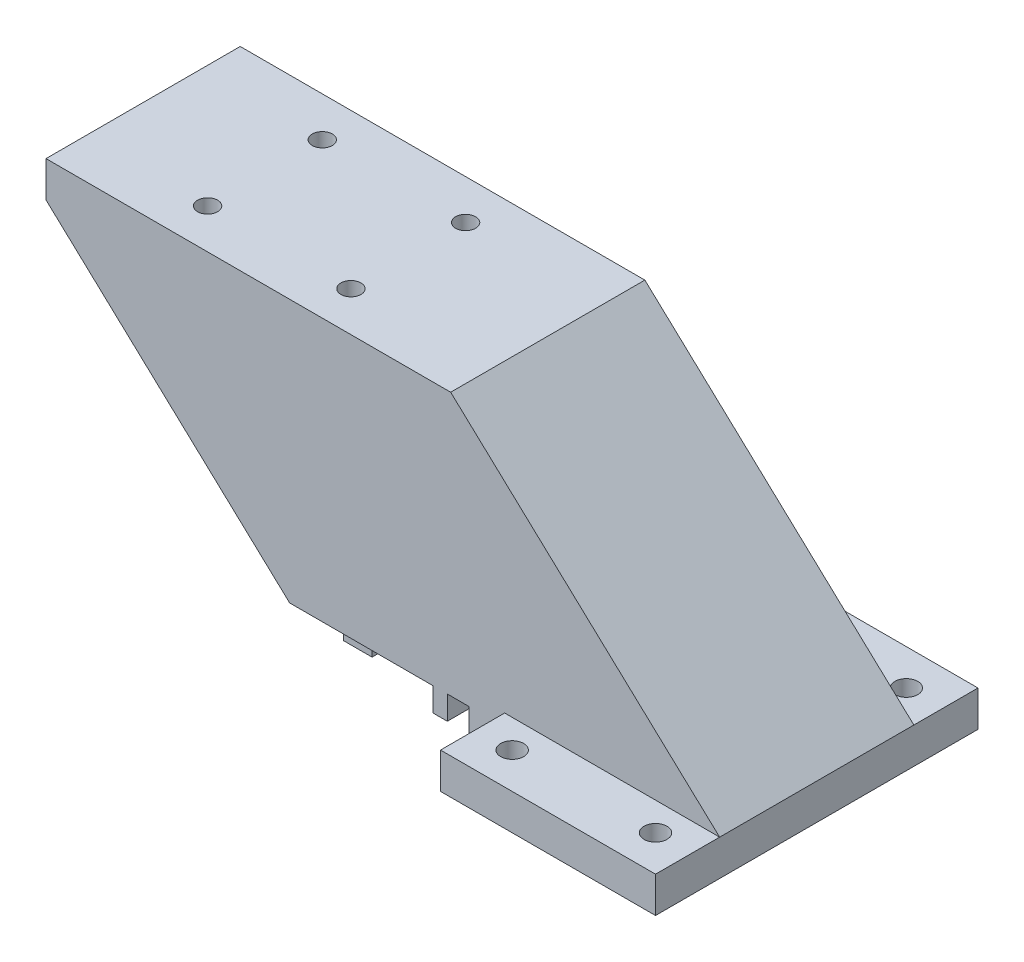
ISO-10303-21;
HEADER;
FILE_DESCRIPTION(('STEP AP214'),'2;1');
FILE_NAME('part.step','',(''),(''),'','','');
FILE_SCHEMA(('AUTOMOTIVE_DESIGN { 1 0 10303 214 1 1 1 1 }'));
ENDSEC;
DATA;
#1=APPLICATION_CONTEXT('core data for automotive mechanical design processes');
#2=APPLICATION_PROTOCOL_DEFINITION('international standard','automotive_design',2000,#1);
#3=PRODUCT_CONTEXT('',#1,'mechanical');
#4=PRODUCT('Part','Part','',(#3));
#5=PRODUCT_RELATED_PRODUCT_CATEGORY('part','',(#4));
#6=PRODUCT_DEFINITION_FORMATION('','',#4);
#7=PRODUCT_DEFINITION_CONTEXT('part definition',#1,'design');
#8=PRODUCT_DEFINITION('design','',#6,#7);
#9=PRODUCT_DEFINITION_SHAPE('','',#8);
#10=(LENGTH_UNIT() NAMED_UNIT(*) SI_UNIT(.MILLI.,.METRE.));
#11=(NAMED_UNIT(*) PLANE_ANGLE_UNIT() SI_UNIT($,.RADIAN.));
#12=(NAMED_UNIT(*) SI_UNIT($,.STERADIAN.) SOLID_ANGLE_UNIT());
#13=UNCERTAINTY_MEASURE_WITH_UNIT(LENGTH_MEASURE(1.E-05),#10,'distance_accuracy_value','');
#14=(GEOMETRIC_REPRESENTATION_CONTEXT(3) GLOBAL_UNCERTAINTY_ASSIGNED_CONTEXT((#13)) GLOBAL_UNIT_ASSIGNED_CONTEXT((#10,
#11,#12)) REPRESENTATION_CONTEXT('',''));
#15=CARTESIAN_POINT('',(0.,0.,0.));
#16=DIRECTION('',(0.,0.,1.));
#17=DIRECTION('',(1.,0.,0.));
#18=AXIS2_PLACEMENT_3D('',#15,#16,#17);
#19=CARTESIAN_POINT('',(0.,3.3,0.));
#20=DIRECTION('',(0.,1.,0.));
#21=DIRECTION('',(0.,0.,1.));
#22=AXIS2_PLACEMENT_3D('',#19,#20,#21);
#23=PLANE('',#22);
#24=DIRECTION('',(-1.,0.,0.));
#25=VECTOR('',#24,1.);
#26=CARTESIAN_POINT('',(-40.,3.3,-9.99999999999999));
#27=LINE('',#26,#25);
#28=CARTESIAN_POINT('',(-40.,3.3,-9.99999999999999));
#29=VERTEX_POINT('',#28);
#30=CARTESIAN_POINT('',(-45.,3.3,-9.99999999999999));
#31=VERTEX_POINT('',#30);
#32=EDGE_CURVE('E613',#29,#31,#27,.T.);
#33=ORIENTED_EDGE('',*,*,#32,.T.);
#34=DIRECTION('',(0.,0.,1.));
#35=VECTOR('',#34,1.);
#36=CARTESIAN_POINT('',(-45.,3.3,-22.5));
#37=LINE('',#36,#35);
#38=CARTESIAN_POINT('',(-45.,3.3,-13.55));
#39=VERTEX_POINT('',#38);
#40=EDGE_CURVE('E338',#39,#31,#37,.T.);
#41=ORIENTED_EDGE('',*,*,#40,.F.);
#42=DIRECTION('',(-1.,0.,0.));
#43=VECTOR('',#42,1.);
#44=CARTESIAN_POINT('',(0.,3.3,-13.55));
#45=LINE('',#44,#43);
#46=CARTESIAN_POINT('',(-40.,3.3,-13.55));
#47=VERTEX_POINT('',#46);
#48=EDGE_CURVE('E488',#47,#39,#45,.T.);
#49=ORIENTED_EDGE('',*,*,#48,.F.);
#50=DIRECTION('',(0.,0.,-1.));
#51=VECTOR('',#50,1.);
#52=CARTESIAN_POINT('',(-40.,3.3,0.));
#53=LINE('',#52,#51);
#54=EDGE_CURVE('E462',#29,#47,#53,.T.);
#55=ORIENTED_EDGE('',*,*,#54,.F.);
#56=EDGE_LOOP('',(#33,#41,#49,#55));
#57=FACE_BOUND('',#56,.T.);
#58=ADVANCED_FACE('F47',(#57),#23,.F.);
#59=CARTESIAN_POINT('',(-62.,0.,-8.));
#60=DIRECTION('',(0.,1.,0.));
#61=DIRECTION('',(0.,0.,1.));
#62=AXIS2_PLACEMENT_3D('',#59,#60,#61);
#63=CYLINDRICAL_SURFACE('',#62,1.4);
#64=CARTESIAN_POINT('',(-62.,40.,-8.));
#65=DIRECTION('',(0.,1.,0.));
#66=DIRECTION('',(0.,0.,1.));
#67=AXIS2_PLACEMENT_3D('',#64,#65,#66);
#68=CIRCLE('',#67,1.4);
#69=CARTESIAN_POINT('',(-62.,40.,-6.60000000000001));
#70=VERTEX_POINT('',#69);
#71=EDGE_CURVE('E368',#70,#70,#68,.T.);
#72=ORIENTED_EDGE('',*,*,#71,.T.);
#73=EDGE_LOOP('',(#72));
#74=FACE_BOUND('',#73,.T.);
#75=CARTESIAN_POINT('',(-62.,35.,-8.));
#76=DIRECTION('',(0.,-1.,0.));
#77=DIRECTION('',(1.,0.,0.));
#78=AXIS2_PLACEMENT_3D('',#75,#76,#77);
#79=CIRCLE('',#78,1.4);
#80=CARTESIAN_POINT('',(-60.6,35.,-8.));
#81=VERTEX_POINT('',#80);
#82=EDGE_CURVE('E644',#81,#81,#79,.F.);
#83=ORIENTED_EDGE('',*,*,#82,.F.);
#84=EDGE_LOOP('',(#83));
#85=FACE_BOUND('',#84,.T.);
#86=ADVANCED_FACE('F548',(#74,#85),#63,.F.);
#87=CARTESIAN_POINT('',(-62.,0.,8.));
#88=DIRECTION('',(0.,1.,0.));
#89=DIRECTION('',(0.,0.,1.));
#90=AXIS2_PLACEMENT_3D('',#87,#88,#89);
#91=CYLINDRICAL_SURFACE('',#90,1.40000000000016);
#92=CARTESIAN_POINT('',(-62.,40.,8.));
#93=DIRECTION('',(0.,1.,0.));
#94=DIRECTION('',(0.,0.,1.));
#95=AXIS2_PLACEMENT_3D('',#92,#93,#94);
#96=CIRCLE('',#95,1.40000000000016);
#97=CARTESIAN_POINT('',(-62.,40.,9.40000000000015));
#98=VERTEX_POINT('',#97);
#99=EDGE_CURVE('E363',#98,#98,#96,.T.);
#100=ORIENTED_EDGE('',*,*,#99,.T.);
#101=EDGE_LOOP('',(#100));
#102=FACE_BOUND('',#101,.T.);
#103=CARTESIAN_POINT('',(-62.,35.,8.));
#104=DIRECTION('',(0.,-1.,0.));
#105=DIRECTION('',(1.,0.,0.));
#106=AXIS2_PLACEMENT_3D('',#103,#104,#105);
#107=CIRCLE('',#106,1.40000000000016);
#108=CARTESIAN_POINT('',(-60.5999999999998,35.,8.));
#109=VERTEX_POINT('',#108);
#110=EDGE_CURVE('E640',#109,#109,#107,.F.);
#111=ORIENTED_EDGE('',*,*,#110,.F.);
#112=EDGE_LOOP('',(#111));
#113=FACE_BOUND('',#112,.T.);
#114=ADVANCED_FACE('F556',(#102,#113),#91,.F.);
#115=CARTESIAN_POINT('',(-42.,0.,-8.));
#116=DIRECTION('',(0.,1.,0.));
#117=DIRECTION('',(0.,0.,1.));
#118=AXIS2_PLACEMENT_3D('',#115,#116,#117);
#119=CYLINDRICAL_SURFACE('',#118,1.39999999999999);
#120=CARTESIAN_POINT('',(-42.,40.,-8.));
#121=DIRECTION('',(0.,1.,0.));
#122=DIRECTION('',(0.,0.,1.));
#123=AXIS2_PLACEMENT_3D('',#120,#121,#122);
#124=CIRCLE('',#123,1.39999999999999);
#125=CARTESIAN_POINT('',(-42.,40.,-6.60000000000001));
#126=VERTEX_POINT('',#125);
#127=EDGE_CURVE('E364',#126,#126,#124,.T.);
#128=ORIENTED_EDGE('',*,*,#127,.T.);
#129=EDGE_LOOP('',(#128));
#130=FACE_BOUND('',#129,.T.);
#131=CARTESIAN_POINT('',(-42.,35.,-8.));
#132=DIRECTION('',(0.,-1.,0.));
#133=DIRECTION('',(1.,0.,0.));
#134=AXIS2_PLACEMENT_3D('',#131,#132,#133);
#135=CIRCLE('',#134,1.39999999999999);
#136=CARTESIAN_POINT('',(-40.6,35.,-8.));
#137=VERTEX_POINT('',#136);
#138=EDGE_CURVE('E636',#137,#137,#135,.F.);
#139=ORIENTED_EDGE('',*,*,#138,.F.);
#140=EDGE_LOOP('',(#139));
#141=FACE_BOUND('',#140,.T.);
#142=ADVANCED_FACE('F718',(#130,#141),#119,.F.);
#143=CARTESIAN_POINT('',(-42.,0.,8.));
#144=DIRECTION('',(0.,1.,0.));
#145=DIRECTION('',(0.,0.,1.));
#146=AXIS2_PLACEMENT_3D('',#143,#144,#145);
#147=CYLINDRICAL_SURFACE('',#146,1.39999999999999);
#148=CARTESIAN_POINT('',(-42.,40.,8.));
#149=DIRECTION('',(0.,1.,0.));
#150=DIRECTION('',(0.,0.,1.));
#151=AXIS2_PLACEMENT_3D('',#148,#149,#150);
#152=CIRCLE('',#151,1.39999999999999);
#153=CARTESIAN_POINT('',(-42.,40.,9.39999999999999));
#154=VERTEX_POINT('',#153);
#155=EDGE_CURVE('E369',#154,#154,#152,.T.);
#156=ORIENTED_EDGE('',*,*,#155,.T.);
#157=EDGE_LOOP('',(#156));
#158=FACE_BOUND('',#157,.T.);
#159=CARTESIAN_POINT('',(-42.,35.,8.));
#160=DIRECTION('',(0.,-1.,0.));
#161=DIRECTION('',(1.,0.,0.));
#162=AXIS2_PLACEMENT_3D('',#159,#160,#161);
#163=CIRCLE('',#162,1.39999999999999);
#164=CARTESIAN_POINT('',(-40.6,35.,8.));
#165=VERTEX_POINT('',#164);
#166=EDGE_CURVE('E632',#165,#165,#163,.F.);
#167=ORIENTED_EDGE('',*,*,#166,.F.);
#168=EDGE_LOOP('',(#167));
#169=FACE_BOUND('',#168,.T.);
#170=ADVANCED_FACE('F721',(#158,#169),#147,.F.);
#171=CARTESIAN_POINT('',(-19.2806251128007,-20.6795348213005,-22.5));
#172=DIRECTION('',(-0.681934923661635,-0.731412851876832,0.));
#173=DIRECTION('',(0.731412851876832,-0.681934923661635,0.));
#174=AXIS2_PLACEMENT_3D('',#171,#172,#173);
#175=PLANE('',#174);
#176=ORIENTED_EDGE('',*,*,#40,.T.);
#177=DIRECTION('',(-0.731412851876832,0.681934923661635,0.));
#178=VECTOR('',#177,1.);
#179=CARTESIAN_POINT('',(-19.2806251128007,-20.6795348213005,-10.));
#180=LINE('',#179,#178);
#181=CARTESIAN_POINT('',(-79.,35.,-9.99999999999999));
#182=VERTEX_POINT('',#181);
#183=EDGE_CURVE('E56',#31,#182,#180,.T.);
#184=ORIENTED_EDGE('',*,*,#183,.T.);
#185=DIRECTION('',(0.,0.,1.));
#186=VECTOR('',#185,1.);
#187=CARTESIAN_POINT('',(-79.,35.,-22.5));
#188=LINE('',#187,#186);
#189=CARTESIAN_POINT('',(-79.,35.,-13.55));
#190=VERTEX_POINT('',#189);
#191=EDGE_CURVE('E335',#190,#182,#188,.T.);
#192=ORIENTED_EDGE('',*,*,#191,.F.);
#193=DIRECTION('',(-0.731412851876832,0.681934923661635,0.));
#194=VECTOR('',#193,1.);
#195=CARTESIAN_POINT('',(-20.926585804923,-19.1449185289395,-13.55));
#196=LINE('',#195,#194);
#197=EDGE_CURVE('E360',#39,#190,#196,.T.);
#198=ORIENTED_EDGE('',*,*,#197,.F.);
#199=EDGE_LOOP('',(#176,#184,#192,#198));
#200=FACE_BOUND('',#199,.T.);
#201=ADVANCED_FACE('F334',(#200),#175,.T.);
#202=CARTESIAN_POINT('',(-45.,3.3,10.));
#203=VERTEX_POINT('',#202);
#204=CARTESIAN_POINT('',(-45.,3.3,13.55));
#205=VERTEX_POINT('',#204);
#206=EDGE_CURVE('E351',#203,#205,#37,.T.);
#207=ORIENTED_EDGE('',*,*,#206,.F.);
#208=DIRECTION('',(-1.,0.,0.));
#209=VECTOR('',#208,1.);
#210=CARTESIAN_POINT('',(-40.,3.3,10.));
#211=LINE('',#210,#209);
#212=CARTESIAN_POINT('',(-40.,3.3,10.));
#213=VERTEX_POINT('',#212);
#214=EDGE_CURVE('E70',#213,#203,#211,.T.);
#215=ORIENTED_EDGE('',*,*,#214,.F.);
#216=CARTESIAN_POINT('',(-40.,3.3,11.05));
#217=VERTEX_POINT('',#216);
#218=EDGE_CURVE('E444',#217,#213,#53,.T.);
#219=ORIENTED_EDGE('',*,*,#218,.F.);
#220=DIRECTION('',(1.,0.,0.));
#221=VECTOR('',#220,1.);
#222=CARTESIAN_POINT('',(0.,3.3,11.05));
#223=LINE('',#222,#221);
#224=CARTESIAN_POINT('',(-36.,3.3,11.05));
#225=VERTEX_POINT('',#224);
#226=EDGE_CURVE('E458',#217,#225,#223,.T.);
#227=ORIENTED_EDGE('',*,*,#226,.T.);
#228=DIRECTION('',(0.,0.,-1.));
#229=VECTOR('',#228,1.);
#230=CARTESIAN_POINT('',(-36.,3.3,0.));
#231=LINE('',#230,#229);
#232=CARTESIAN_POINT('',(-36.,3.3,-13.55));
#233=VERTEX_POINT('',#232);
#234=EDGE_CURVE('E438',#225,#233,#231,.T.);
#235=ORIENTED_EDGE('',*,*,#234,.T.);
#236=CARTESIAN_POINT('',(-25.,3.3,-13.55));
#237=VERTEX_POINT('',#236);
#238=EDGE_CURVE('E494',#237,#233,#45,.T.);
#239=ORIENTED_EDGE('',*,*,#238,.F.);
#240=DIRECTION('',(0.,0.,-1.));
#241=VECTOR('',#240,1.);
#242=CARTESIAN_POINT('',(-25.,3.3,0.));
#243=LINE('',#242,#241);
#244=CARTESIAN_POINT('',(-25.,3.3,13.55));
#245=VERTEX_POINT('',#244);
#246=EDGE_CURVE('E385',#245,#237,#243,.T.);
#247=ORIENTED_EDGE('',*,*,#246,.F.);
#248=DIRECTION('',(-1.,0.,0.));
#249=VECTOR('',#248,1.);
#250=CARTESIAN_POINT('',(0.,3.3,13.55));
#251=LINE('',#250,#249);
#252=EDGE_CURVE('E493',#245,#205,#251,.T.);
#253=ORIENTED_EDGE('',*,*,#252,.T.);
#254=EDGE_LOOP('',(#207,#215,#219,#227,#235,#239,#247,#253));
#255=FACE_BOUND('',#254,.T.);
#256=ADVANCED_FACE('F551',(#255),#23,.F.);
#257=CARTESIAN_POINT('',(0.,3.3,-13.55));
#258=DIRECTION('',(0.,0.,-1.));
#259=DIRECTION('',(-1.,0.,0.));
#260=AXIS2_PLACEMENT_3D('',#257,#258,#259);
#261=PLANE('',#260);
#262=DIRECTION('',(-0.731353701619174,0.681998360062495,0.));
#263=VECTOR('',#262,1.);
#264=CARTESIAN_POINT('',(9.47073657256854,10.156121561309,-13.55));
#265=LINE('',#264,#263);
#266=CARTESIAN_POINT('',(15.,5.,-13.55));
#267=VERTEX_POINT('',#266);
#268=CARTESIAN_POINT('',(-22.5329048508643,40.,-13.55));
#269=VERTEX_POINT('',#268);
#270=EDGE_CURVE('E62',#267,#269,#265,.T.);
#271=ORIENTED_EDGE('',*,*,#270,.F.);
#272=DIRECTION('',(-1.,0.,0.));
#273=VECTOR('',#272,1.);
#274=CARTESIAN_POINT('',(0.,5.,-13.55));
#275=LINE('',#274,#273);
#276=CARTESIAN_POINT('',(-15.,5.,-13.55));
#277=VERTEX_POINT('',#276);
#278=EDGE_CURVE('E237',#267,#277,#275,.T.);
#279=ORIENTED_EDGE('',*,*,#278,.T.);
#280=DIRECTION('',(0.,1.,0.));
#281=VECTOR('',#280,1.);
#282=CARTESIAN_POINT('',(-15.,5.,-13.55));
#283=LINE('',#282,#281);
#284=CARTESIAN_POINT('',(-15.,0.,-13.55));
#285=VERTEX_POINT('',#284);
#286=EDGE_CURVE('E284',#285,#277,#283,.T.);
#287=ORIENTED_EDGE('',*,*,#286,.F.);
#288=DIRECTION('',(1.,0.,0.));
#289=VECTOR('',#288,1.);
#290=CARTESIAN_POINT('',(0.,0.,-13.55));
#291=LINE('',#290,#289);
#292=CARTESIAN_POINT('',(-20.,0.,-13.55));
#293=VERTEX_POINT('',#292);
#294=EDGE_CURVE('E423',#293,#285,#291,.T.);
#295=ORIENTED_EDGE('',*,*,#294,.F.);
#296=DIRECTION('',(0.,1.,0.));
#297=VECTOR('',#296,1.);
#298=CARTESIAN_POINT('',(-20.,0.,-13.55));
#299=LINE('',#298,#297);
#300=CARTESIAN_POINT('',(-20.,3.3,-13.55));
#301=VERTEX_POINT('',#300);
#302=EDGE_CURVE('E427',#293,#301,#299,.T.);
#303=ORIENTED_EDGE('',*,*,#302,.T.);
#304=CARTESIAN_POINT('',(-23.,3.3,-13.55));
#305=VERTEX_POINT('',#304);
#306=EDGE_CURVE('E489',#301,#305,#45,.T.);
#307=ORIENTED_EDGE('',*,*,#306,.T.);
#308=DIRECTION('',(0.,1.,0.));
#309=VECTOR('',#308,1.);
#310=CARTESIAN_POINT('',(-23.,0.,-13.55));
#311=LINE('',#310,#309);
#312=CARTESIAN_POINT('',(-23.,0.,-13.55));
#313=VERTEX_POINT('',#312);
#314=EDGE_CURVE('E394',#313,#305,#311,.T.);
#315=ORIENTED_EDGE('',*,*,#314,.F.);
#316=DIRECTION('',(1.,0.,0.));
#317=VECTOR('',#316,1.);
#318=CARTESIAN_POINT('',(0.,0.,-13.55));
#319=LINE('',#318,#317);
#320=CARTESIAN_POINT('',(-25.,0.,-13.55));
#321=VERTEX_POINT('',#320);
#322=EDGE_CURVE('E391',#321,#313,#319,.T.);
#323=ORIENTED_EDGE('',*,*,#322,.F.);
#324=DIRECTION('',(0.,1.,0.));
#325=VECTOR('',#324,1.);
#326=CARTESIAN_POINT('',(-25.,0.,-13.55));
#327=LINE('',#326,#325);
#328=EDGE_CURVE('E403',#321,#237,#327,.T.);
#329=ORIENTED_EDGE('',*,*,#328,.T.);
#330=ORIENTED_EDGE('',*,*,#238,.T.);
#331=DIRECTION('',(0.,1.,0.));
#332=VECTOR('',#331,1.);
#333=CARTESIAN_POINT('',(-36.,0.,-13.55));
#334=LINE('',#333,#332);
#335=CARTESIAN_POINT('',(-36.,0.,-13.55));
#336=VERTEX_POINT('',#335);
#337=EDGE_CURVE('E454',#336,#233,#334,.T.);
#338=ORIENTED_EDGE('',*,*,#337,.F.);
#339=DIRECTION('',(1.,0.,0.));
#340=VECTOR('',#339,1.);
#341=CARTESIAN_POINT('',(0.,0.,-13.55));
#342=LINE('',#341,#340);
#343=CARTESIAN_POINT('',(-40.,0.,-13.55));
#344=VERTEX_POINT('',#343);
#345=EDGE_CURVE('E451',#344,#336,#342,.T.);
#346=ORIENTED_EDGE('',*,*,#345,.F.);
#347=DIRECTION('',(0.,1.,0.));
#348=VECTOR('',#347,1.);
#349=CARTESIAN_POINT('',(-40.,0.,-13.55));
#350=LINE('',#349,#348);
#351=EDGE_CURVE('E469',#344,#47,#350,.T.);
#352=ORIENTED_EDGE('',*,*,#351,.T.);
#353=ORIENTED_EDGE('',*,*,#48,.T.);
#354=ORIENTED_EDGE('',*,*,#197,.T.);
#355=DIRECTION('',(0.,1.,0.));
#356=VECTOR('',#355,1.);
#357=CARTESIAN_POINT('',(-79.,3.3,-13.55));
#358=LINE('',#357,#356);
#359=CARTESIAN_POINT('',(-79.,40.,-13.55));
#360=VERTEX_POINT('',#359);
#361=EDGE_CURVE('E349',#190,#360,#358,.T.);
#362=ORIENTED_EDGE('',*,*,#361,.T.);
#363=DIRECTION('',(-1.,0.,0.));
#364=VECTOR('',#363,1.);
#365=CARTESIAN_POINT('',(0.,40.,-13.55));
#366=LINE('',#365,#364);
#367=EDGE_CURVE('E240',#269,#360,#366,.T.);
#368=ORIENTED_EDGE('',*,*,#367,.F.);
#369=EDGE_LOOP('',(#271,#279,#287,#295,#303,#307,#315,#323,#329,#330,#338,#346,#352,#353,#354,
#362,#368));
#370=FACE_BOUND('',#369,.T.);
#371=ADVANCED_FACE('F236',(#370),#261,.T.);
#372=CARTESIAN_POINT('',(0.,3.3,13.55));
#373=DIRECTION('',(0.,0.,-1.));
#374=DIRECTION('',(-1.,0.,0.));
#375=AXIS2_PLACEMENT_3D('',#372,#373,#374);
#376=PLANE('',#375);
#377=DIRECTION('',(-1.,0.,0.));
#378=VECTOR('',#377,1.);
#379=CARTESIAN_POINT('',(0.,5.,13.55));
#380=LINE('',#379,#378);
#381=CARTESIAN_POINT('',(15.,5.,13.55));
#382=VERTEX_POINT('',#381);
#383=CARTESIAN_POINT('',(-15.,5.,13.55));
#384=VERTEX_POINT('',#383);
#385=EDGE_CURVE('E255',#382,#384,#380,.T.);
#386=ORIENTED_EDGE('',*,*,#385,.F.);
#387=DIRECTION('',(-0.731353701619174,0.681998360062495,0.));
#388=VECTOR('',#387,1.);
#389=CARTESIAN_POINT('',(7.82475588963983,11.6910233796312,13.55));
#390=LINE('',#389,#388);
#391=CARTESIAN_POINT('',(-22.5329048508643,40.,13.55));
#392=VERTEX_POINT('',#391);
#393=EDGE_CURVE('E227',#382,#392,#390,.T.);
#394=ORIENTED_EDGE('',*,*,#393,.T.);
#395=DIRECTION('',(-1.,0.,0.));
#396=VECTOR('',#395,1.);
#397=CARTESIAN_POINT('',(0.,40.,13.55));
#398=LINE('',#397,#396);
#399=CARTESIAN_POINT('',(-79.,40.,13.55));
#400=VERTEX_POINT('',#399);
#401=EDGE_CURVE('E485',#392,#400,#398,.T.);
#402=ORIENTED_EDGE('',*,*,#401,.T.);
#403=DIRECTION('',(0.,1.,0.));
#404=VECTOR('',#403,1.);
#405=CARTESIAN_POINT('',(-79.,3.3,13.55));
#406=LINE('',#405,#404);
#407=CARTESIAN_POINT('',(-79.,35.,13.55));
#408=VERTEX_POINT('',#407);
#409=EDGE_CURVE('E498',#408,#400,#406,.T.);
#410=ORIENTED_EDGE('',*,*,#409,.F.);
#411=DIRECTION('',(0.731412851876832,-0.681934923661635,0.));
#412=VECTOR('',#411,1.);
#413=CARTESIAN_POINT('',(-19.2806251128007,-20.6795348213005,13.55));
#414=LINE('',#413,#412);
#415=EDGE_CURVE('E357',#408,#205,#414,.T.);
#416=ORIENTED_EDGE('',*,*,#415,.T.);
#417=ORIENTED_EDGE('',*,*,#252,.F.);
#418=DIRECTION('',(0.,1.,0.));
#419=VECTOR('',#418,1.);
#420=CARTESIAN_POINT('',(-25.,0.,13.55));
#421=LINE('',#420,#419);
#422=CARTESIAN_POINT('',(-25.,0.,13.55));
#423=VERTEX_POINT('',#422);
#424=EDGE_CURVE('E407',#423,#245,#421,.T.);
#425=ORIENTED_EDGE('',*,*,#424,.F.);
#426=DIRECTION('',(-1.,0.,0.));
#427=VECTOR('',#426,1.);
#428=CARTESIAN_POINT('',(0.,0.,13.55));
#429=LINE('',#428,#427);
#430=CARTESIAN_POINT('',(-23.,0.,13.55));
#431=VERTEX_POINT('',#430);
#432=EDGE_CURVE('E384',#431,#423,#429,.T.);
#433=ORIENTED_EDGE('',*,*,#432,.F.);
#434=DIRECTION('',(0.,1.,0.));
#435=VECTOR('',#434,1.);
#436=CARTESIAN_POINT('',(-23.,0.,13.55));
#437=LINE('',#436,#435);
#438=CARTESIAN_POINT('',(-23.,3.3,13.55));
#439=VERTEX_POINT('',#438);
#440=EDGE_CURVE('E411',#431,#439,#437,.T.);
#441=ORIENTED_EDGE('',*,*,#440,.T.);
#442=CARTESIAN_POINT('',(-20.,3.3,13.55));
#443=VERTEX_POINT('',#442);
#444=EDGE_CURVE('E495',#443,#439,#251,.T.);
#445=ORIENTED_EDGE('',*,*,#444,.F.);
#446=DIRECTION('',(0.,1.,0.));
#447=VECTOR('',#446,1.);
#448=CARTESIAN_POINT('',(-20.,0.,13.55));
#449=LINE('',#448,#447);
#450=CARTESIAN_POINT('',(-20.,0.,13.55));
#451=VERTEX_POINT('',#450);
#452=EDGE_CURVE('E434',#451,#443,#449,.T.);
#453=ORIENTED_EDGE('',*,*,#452,.F.);
#454=DIRECTION('',(-1.,0.,0.));
#455=VECTOR('',#454,1.);
#456=CARTESIAN_POINT('',(0.,0.,13.55));
#457=LINE('',#456,#455);
#458=CARTESIAN_POINT('',(-15.,0.,13.55));
#459=VERTEX_POINT('',#458);
#460=EDGE_CURVE('E416',#459,#451,#457,.T.);
#461=ORIENTED_EDGE('',*,*,#460,.F.);
#462=DIRECTION('',(0.,1.,0.));
#463=VECTOR('',#462,1.);
#464=CARTESIAN_POINT('',(-15.,5.,13.55));
#465=LINE('',#464,#463);
#466=EDGE_CURVE('E502',#459,#384,#465,.T.);
#467=ORIENTED_EDGE('',*,*,#466,.T.);
#468=EDGE_LOOP('',(#386,#394,#402,#410,#416,#417,#425,#433,#441,#445,#453,#461,#467));
#469=FACE_BOUND('',#468,.T.);
#470=ADVANCED_FACE('F577',(#469),#376,.F.);
#471=CARTESIAN_POINT('',(-79.,3.3,0.));
#472=DIRECTION('',(-1.,0.,0.));
#473=DIRECTION('',(0.,0.,1.));
#474=AXIS2_PLACEMENT_3D('',#471,#472,#473);
#475=PLANE('',#474);
#476=ORIENTED_EDGE('',*,*,#361,.F.);
#477=ORIENTED_EDGE('',*,*,#191,.T.);
#478=DIRECTION('',(0.,0.,1.));
#479=VECTOR('',#478,1.);
#480=CARTESIAN_POINT('',(-79.,35.,-9.99999999999999));
#481=LINE('',#480,#479);
#482=CARTESIAN_POINT('',(-79.,35.,10.));
#483=VERTEX_POINT('',#482);
#484=EDGE_CURVE('E347',#182,#483,#481,.T.);
#485=ORIENTED_EDGE('',*,*,#484,.T.);
#486=EDGE_CURVE('E352',#483,#408,#188,.T.);
#487=ORIENTED_EDGE('',*,*,#486,.T.);
#488=ORIENTED_EDGE('',*,*,#409,.T.);
#489=DIRECTION('',(0.,0.,1.));
#490=VECTOR('',#489,1.);
#491=CARTESIAN_POINT('',(-79.,40.,0.));
#492=LINE('',#491,#490);
#493=EDGE_CURVE('E481',#360,#400,#492,.T.);
#494=ORIENTED_EDGE('',*,*,#493,.F.);
#495=EDGE_LOOP('',(#476,#477,#485,#487,#488,#494));
#496=FACE_BOUND('',#495,.T.);
#497=ADVANCED_FACE('F345',(#496),#475,.T.);
#498=CARTESIAN_POINT('',(-15.,5.,0.));
#499=DIRECTION('',(1.,0.,0.));
#500=DIRECTION('',(0.,0.,-1.));
#501=AXIS2_PLACEMENT_3D('',#498,#499,#500);
#502=PLANE('',#501);
#503=ORIENTED_EDGE('',*,*,#466,.F.);
#504=DIRECTION('',(0.,0.,1.));
#505=VECTOR('',#504,1.);
#506=CARTESIAN_POINT('',(-15.,0.,0.));
#507=LINE('',#506,#505);
#508=CARTESIAN_POINT('',(-15.,0.,22.5));
#509=VERTEX_POINT('',#508);
#510=EDGE_CURVE('E304',#459,#509,#507,.T.);
#511=ORIENTED_EDGE('',*,*,#510,.T.);
#512=DIRECTION('',(0.,-1.,0.));
#513=VECTOR('',#512,1.);
#514=CARTESIAN_POINT('',(-15.,5.,22.5));
#515=LINE('',#514,#513);
#516=CARTESIAN_POINT('',(-15.,5.,22.5));
#517=VERTEX_POINT('',#516);
#518=EDGE_CURVE('E316',#517,#509,#515,.T.);
#519=ORIENTED_EDGE('',*,*,#518,.F.);
#520=DIRECTION('',(0.,0.,1.));
#521=VECTOR('',#520,1.);
#522=CARTESIAN_POINT('',(-15.,5.,0.));
#523=LINE('',#522,#521);
#524=EDGE_CURVE('E266',#384,#517,#523,.T.);
#525=ORIENTED_EDGE('',*,*,#524,.F.);
#526=EDGE_LOOP('',(#503,#511,#519,#525));
#527=FACE_BOUND('',#526,.T.);
#528=ADVANCED_FACE('F569',(#527),#502,.F.);
#529=CARTESIAN_POINT('',(-15.,0.,-22.5));
#530=VERTEX_POINT('',#529);
#531=EDGE_CURVE('E305',#530,#285,#507,.T.);
#532=ORIENTED_EDGE('',*,*,#531,.T.);
#533=ORIENTED_EDGE('',*,*,#286,.T.);
#534=CARTESIAN_POINT('',(-15.,5.,-22.5));
#535=VERTEX_POINT('',#534);
#536=EDGE_CURVE('E252',#535,#277,#523,.T.);
#537=ORIENTED_EDGE('',*,*,#536,.F.);
#538=DIRECTION('',(0.,-1.,0.));
#539=VECTOR('',#538,1.);
#540=CARTESIAN_POINT('',(-15.,5.,-22.5));
#541=LINE('',#540,#539);
#542=EDGE_CURVE('E320',#535,#530,#541,.T.);
#543=ORIENTED_EDGE('',*,*,#542,.T.);
#544=EDGE_LOOP('',(#532,#533,#537,#543));
#545=FACE_BOUND('',#544,.T.);
#546=ADVANCED_FACE('F564',(#545),#502,.F.);
#547=ORIENTED_EDGE('',*,*,#444,.T.);
#548=DIRECTION('',(0.,0.,-1.));
#549=VECTOR('',#548,1.);
#550=CARTESIAN_POINT('',(-23.,3.3,0.));
#551=LINE('',#550,#549);
#552=EDGE_CURVE('E379',#439,#305,#551,.T.);
#553=ORIENTED_EDGE('',*,*,#552,.T.);
#554=ORIENTED_EDGE('',*,*,#306,.F.);
#555=DIRECTION('',(0.,0.,-1.));
#556=VECTOR('',#555,1.);
#557=CARTESIAN_POINT('',(-20.,3.3,0.));
#558=LINE('',#557,#556);
#559=EDGE_CURVE('E415',#443,#301,#558,.T.);
#560=ORIENTED_EDGE('',*,*,#559,.F.);
#561=EDGE_LOOP('',(#547,#553,#554,#560));
#562=FACE_BOUND('',#561,.T.);
#563=ADVANCED_FACE('F545',(#562),#23,.F.);
#564=CARTESIAN_POINT('',(0.,5.,0.));
#565=DIRECTION('',(0.,1.,0.));
#566=DIRECTION('',(0.,0.,1.));
#567=AXIS2_PLACEMENT_3D('',#564,#565,#566);
#568=PLANE('',#567);
#569=CARTESIAN_POINT('',(10.0000000000002,5.,17.5));
#570=DIRECTION('',(0.,1.,0.));
#571=DIRECTION('',(0.,0.,1.));
#572=AXIS2_PLACEMENT_3D('',#569,#570,#571);
#573=CIRCLE('',#572,1.6);
#574=CARTESIAN_POINT('',(10.0000000000002,5.,19.1));
#575=VERTEX_POINT('',#574);
#576=EDGE_CURVE('E512',#575,#575,#573,.T.);
#577=ORIENTED_EDGE('',*,*,#576,.F.);
#578=EDGE_LOOP('',(#577));
#579=FACE_BOUND('',#578,.T.);
#580=CARTESIAN_POINT('',(-9.99999999999979,5.,17.5));
#581=DIRECTION('',(0.,1.,0.));
#582=DIRECTION('',(0.,0.,1.));
#583=AXIS2_PLACEMENT_3D('',#580,#581,#582);
#584=CIRCLE('',#583,1.6);
#585=CARTESIAN_POINT('',(-9.99999999999979,5.,19.1));
#586=VERTEX_POINT('',#585);
#587=EDGE_CURVE('E313',#586,#586,#584,.T.);
#588=ORIENTED_EDGE('',*,*,#587,.F.);
#589=EDGE_LOOP('',(#588));
#590=FACE_BOUND('',#589,.T.);
#591=DIRECTION('',(0.,0.,1.));
#592=VECTOR('',#591,1.);
#593=CARTESIAN_POINT('',(15.,5.,0.));
#594=LINE('',#593,#592);
#595=CARTESIAN_POINT('',(15.,5.,22.5));
#596=VERTEX_POINT('',#595);
#597=EDGE_CURVE('E262',#382,#596,#594,.T.);
#598=ORIENTED_EDGE('',*,*,#597,.F.);
#599=ORIENTED_EDGE('',*,*,#385,.T.);
#600=ORIENTED_EDGE('',*,*,#524,.T.);
#601=DIRECTION('',(1.,0.,0.));
#602=VECTOR('',#601,1.);
#603=CARTESIAN_POINT('',(0.,5.,22.5));
#604=LINE('',#603,#602);
#605=EDGE_CURVE('E274',#517,#596,#604,.T.);
#606=ORIENTED_EDGE('',*,*,#605,.T.);
#607=EDGE_LOOP('',(#598,#599,#600,#606));
#608=FACE_BOUND('',#607,.T.);
#609=ADVANCED_FACE('F531',(#579,#590,#608),#568,.T.);
#610=CARTESIAN_POINT('',(15.,5.,0.));
#611=DIRECTION('',(1.,0.,0.));
#612=DIRECTION('',(0.,0.,-1.));
#613=AXIS2_PLACEMENT_3D('',#610,#611,#612);
#614=PLANE('',#613);
#615=DIRECTION('',(0.,0.,-1.));
#616=VECTOR('',#615,1.);
#617=CARTESIAN_POINT('',(15.,5.,22.5));
#618=LINE('',#617,#616);
#619=EDGE_CURVE('E224',#382,#267,#618,.T.);
#620=ORIENTED_EDGE('',*,*,#619,.F.);
#621=ORIENTED_EDGE('',*,*,#597,.T.);
#622=DIRECTION('',(0.,-1.,0.));
#623=VECTOR('',#622,1.);
#624=CARTESIAN_POINT('',(15.,5.,22.5));
#625=LINE('',#624,#623);
#626=CARTESIAN_POINT('',(15.,0.,22.5));
#627=VERTEX_POINT('',#626);
#628=EDGE_CURVE('E278',#596,#627,#625,.T.);
#629=ORIENTED_EDGE('',*,*,#628,.T.);
#630=DIRECTION('',(0.,0.,1.));
#631=VECTOR('',#630,1.);
#632=CARTESIAN_POINT('',(15.,0.,0.));
#633=LINE('',#632,#631);
#634=CARTESIAN_POINT('',(15.,0.,-22.5));
#635=VERTEX_POINT('',#634);
#636=EDGE_CURVE('E296',#635,#627,#633,.T.);
#637=ORIENTED_EDGE('',*,*,#636,.F.);
#638=DIRECTION('',(0.,-1.,0.));
#639=VECTOR('',#638,1.);
#640=CARTESIAN_POINT('',(15.,5.,-22.5));
#641=LINE('',#640,#639);
#642=CARTESIAN_POINT('',(15.,5.,-22.5));
#643=VERTEX_POINT('',#642);
#644=EDGE_CURVE('E259',#643,#635,#641,.T.);
#645=ORIENTED_EDGE('',*,*,#644,.F.);
#646=EDGE_CURVE('E249',#643,#267,#594,.T.);
#647=ORIENTED_EDGE('',*,*,#646,.T.);
#648=EDGE_LOOP('',(#620,#621,#629,#637,#645,#647));
#649=FACE_BOUND('',#648,.T.);
#650=ADVANCED_FACE('F257',(#649),#614,.T.);
#651=CARTESIAN_POINT('',(0.,5.,-22.5));
#652=DIRECTION('',(0.,0.,-1.));
#653=DIRECTION('',(-1.,0.,0.));
#654=AXIS2_PLACEMENT_3D('',#651,#652,#653);
#655=PLANE('',#654);
#656=DIRECTION('',(1.,0.,0.));
#657=VECTOR('',#656,1.);
#658=CARTESIAN_POINT('',(0.,0.,-22.5));
#659=LINE('',#658,#657);
#660=EDGE_CURVE('E300',#530,#635,#659,.T.);
#661=ORIENTED_EDGE('',*,*,#660,.F.);
#662=ORIENTED_EDGE('',*,*,#542,.F.);
#663=DIRECTION('',(1.,0.,0.));
#664=VECTOR('',#663,1.);
#665=CARTESIAN_POINT('',(0.,5.,-22.5));
#666=LINE('',#665,#664);
#667=EDGE_CURVE('E261',#535,#643,#666,.T.);
#668=ORIENTED_EDGE('',*,*,#667,.T.);
#669=ORIENTED_EDGE('',*,*,#644,.T.);
#670=EDGE_LOOP('',(#661,#662,#668,#669));
#671=FACE_BOUND('',#670,.T.);
#672=ADVANCED_FACE('F808',(#671),#655,.T.);
#673=CARTESIAN_POINT('',(-10.,5.,-17.5));
#674=DIRECTION('',(0.,-1.,0.));
#675=DIRECTION('',(0.,0.,-1.));
#676=AXIS2_PLACEMENT_3D('',#673,#674,#675);
#677=CYLINDRICAL_SURFACE('',#676,1.6);
#678=CARTESIAN_POINT('',(-10.,5.,-17.5));
#679=DIRECTION('',(0.,1.,0.));
#680=DIRECTION('',(0.,0.,1.));
#681=AXIS2_PLACEMENT_3D('',#678,#679,#680);
#682=CIRCLE('',#681,1.6);
#683=CARTESIAN_POINT('',(-10.,5.,-15.9));
#684=VERTEX_POINT('',#683);
#685=EDGE_CURVE('E268',#684,#684,#682,.T.);
#686=ORIENTED_EDGE('',*,*,#685,.T.);
#687=EDGE_LOOP('',(#686));
#688=FACE_BOUND('',#687,.T.);
#689=CARTESIAN_POINT('',(-10.,0.,-17.5));
#690=DIRECTION('',(0.,1.,0.));
#691=DIRECTION('',(0.,0.,1.));
#692=AXIS2_PLACEMENT_3D('',#689,#690,#691);
#693=CIRCLE('',#692,1.6);
#694=CARTESIAN_POINT('',(-10.,0.,-15.9));
#695=VERTEX_POINT('',#694);
#696=EDGE_CURVE('E292',#695,#695,#693,.T.);
#697=ORIENTED_EDGE('',*,*,#696,.F.);
#698=EDGE_LOOP('',(#697));
#699=FACE_BOUND('',#698,.T.);
#700=ADVANCED_FACE('F524',(#688,#699),#677,.F.);
#701=CARTESIAN_POINT('',(10.,5.,-17.5));
#702=DIRECTION('',(0.,-1.,0.));
#703=DIRECTION('',(0.,0.,-1.));
#704=AXIS2_PLACEMENT_3D('',#701,#702,#703);
#705=CYLINDRICAL_SURFACE('',#704,1.6);
#706=CARTESIAN_POINT('',(10.,5.,-17.5));
#707=DIRECTION('',(0.,1.,0.));
#708=DIRECTION('',(0.,0.,1.));
#709=AXIS2_PLACEMENT_3D('',#706,#707,#708);
#710=CIRCLE('',#709,1.6);
#711=CARTESIAN_POINT('',(10.,5.,-15.9));
#712=VERTEX_POINT('',#711);
#713=EDGE_CURVE('E515',#712,#712,#710,.T.);
#714=ORIENTED_EDGE('',*,*,#713,.T.);
#715=EDGE_LOOP('',(#714));
#716=FACE_BOUND('',#715,.T.);
#717=CARTESIAN_POINT('',(10.,0.,-17.5));
#718=DIRECTION('',(0.,1.,0.));
#719=DIRECTION('',(0.,0.,1.));
#720=AXIS2_PLACEMENT_3D('',#717,#718,#719);
#721=CIRCLE('',#720,1.6);
#722=CARTESIAN_POINT('',(10.,0.,-15.9));
#723=VERTEX_POINT('',#722);
#724=EDGE_CURVE('E288',#723,#723,#721,.T.);
#725=ORIENTED_EDGE('',*,*,#724,.F.);
#726=EDGE_LOOP('',(#725));
#727=FACE_BOUND('',#726,.T.);
#728=ADVANCED_FACE('F937',(#716,#727),#705,.F.);
#729=CARTESIAN_POINT('',(10.0000000000002,5.,17.5));
#730=DIRECTION('',(0.,-1.,0.));
#731=DIRECTION('',(0.,0.,-1.));
#732=AXIS2_PLACEMENT_3D('',#729,#730,#731);
#733=CYLINDRICAL_SURFACE('',#732,1.6);
#734=ORIENTED_EDGE('',*,*,#576,.T.);
#735=EDGE_LOOP('',(#734));
#736=FACE_BOUND('',#735,.T.);
#737=CARTESIAN_POINT('',(10.0000000000002,0.,17.5));
#738=DIRECTION('',(0.,1.,0.));
#739=DIRECTION('',(0.,0.,1.));
#740=AXIS2_PLACEMENT_3D('',#737,#738,#739);
#741=CIRCLE('',#740,1.6);
#742=CARTESIAN_POINT('',(10.0000000000002,0.,19.1));
#743=VERTEX_POINT('',#742);
#744=EDGE_CURVE('E283',#743,#743,#741,.T.);
#745=ORIENTED_EDGE('',*,*,#744,.F.);
#746=EDGE_LOOP('',(#745));
#747=FACE_BOUND('',#746,.T.);
#748=ADVANCED_FACE('F928',(#736,#747),#733,.F.);
#749=CARTESIAN_POINT('',(-9.99999999999979,5.,17.5));
#750=DIRECTION('',(0.,-1.,0.));
#751=DIRECTION('',(0.,0.,-1.));
#752=AXIS2_PLACEMENT_3D('',#749,#750,#751);
#753=CYLINDRICAL_SURFACE('',#752,1.6);
#754=ORIENTED_EDGE('',*,*,#587,.T.);
#755=EDGE_LOOP('',(#754));
#756=FACE_BOUND('',#755,.T.);
#757=CARTESIAN_POINT('',(-9.99999999999979,0.,17.5));
#758=DIRECTION('',(0.,1.,0.));
#759=DIRECTION('',(0.,0.,1.));
#760=AXIS2_PLACEMENT_3D('',#757,#758,#759);
#761=CIRCLE('',#760,1.6);
#762=CARTESIAN_POINT('',(-9.99999999999979,0.,19.1));
#763=VERTEX_POINT('',#762);
#764=EDGE_CURVE('E279',#763,#763,#761,.T.);
#765=ORIENTED_EDGE('',*,*,#764,.F.);
#766=EDGE_LOOP('',(#765));
#767=FACE_BOUND('',#766,.T.);
#768=ADVANCED_FACE('F49',(#756,#767),#753,.F.);
#769=CARTESIAN_POINT('',(0.,5.,22.5));
#770=DIRECTION('',(0.,0.,-1.));
#771=DIRECTION('',(-1.,0.,0.));
#772=AXIS2_PLACEMENT_3D('',#769,#770,#771);
#773=PLANE('',#772);
#774=DIRECTION('',(1.,0.,0.));
#775=VECTOR('',#774,1.);
#776=CARTESIAN_POINT('',(0.,0.,22.5));
#777=LINE('',#776,#775);
#778=EDGE_CURVE('E309',#509,#627,#777,.T.);
#779=ORIENTED_EDGE('',*,*,#778,.T.);
#780=ORIENTED_EDGE('',*,*,#628,.F.);
#781=ORIENTED_EDGE('',*,*,#605,.F.);
#782=ORIENTED_EDGE('',*,*,#518,.T.);
#783=EDGE_LOOP('',(#779,#780,#781,#782));
#784=FACE_BOUND('',#783,.T.);
#785=ADVANCED_FACE('F529',(#784),#773,.F.);
#786=ORIENTED_EDGE('',*,*,#278,.F.);
#787=ORIENTED_EDGE('',*,*,#646,.F.);
#788=ORIENTED_EDGE('',*,*,#667,.F.);
#789=ORIENTED_EDGE('',*,*,#536,.T.);
#790=EDGE_LOOP('',(#786,#787,#788,#789));
#791=FACE_BOUND('',#790,.T.);
#792=ORIENTED_EDGE('',*,*,#713,.F.);
#793=EDGE_LOOP('',(#792));
#794=FACE_BOUND('',#793,.T.);
#795=ORIENTED_EDGE('',*,*,#685,.F.);
#796=EDGE_LOOP('',(#795));
#797=FACE_BOUND('',#796,.T.);
#798=ADVANCED_FACE('F246',(#791,#794,#797),#568,.T.);
#799=CARTESIAN_POINT('',(0.,0.,0.));
#800=DIRECTION('',(0.,1.,0.));
#801=DIRECTION('',(0.,0.,1.));
#802=AXIS2_PLACEMENT_3D('',#799,#800,#801);
#803=PLANE('',#802);
#804=ORIENTED_EDGE('',*,*,#764,.T.);
#805=EDGE_LOOP('',(#804));
#806=FACE_BOUND('',#805,.T.);
#807=ORIENTED_EDGE('',*,*,#744,.T.);
#808=EDGE_LOOP('',(#807));
#809=FACE_BOUND('',#808,.T.);
#810=ORIENTED_EDGE('',*,*,#724,.T.);
#811=EDGE_LOOP('',(#810));
#812=FACE_BOUND('',#811,.T.);
#813=ORIENTED_EDGE('',*,*,#696,.T.);
#814=EDGE_LOOP('',(#813));
#815=FACE_BOUND('',#814,.T.);
#816=ORIENTED_EDGE('',*,*,#636,.T.);
#817=ORIENTED_EDGE('',*,*,#778,.F.);
#818=ORIENTED_EDGE('',*,*,#510,.F.);
#819=ORIENTED_EDGE('',*,*,#460,.T.);
#820=DIRECTION('',(0.,0.,-1.));
#821=VECTOR('',#820,1.);
#822=CARTESIAN_POINT('',(-20.,0.,0.));
#823=LINE('',#822,#821);
#824=EDGE_CURVE('E420',#451,#293,#823,.T.);
#825=ORIENTED_EDGE('',*,*,#824,.T.);
#826=ORIENTED_EDGE('',*,*,#294,.T.);
#827=ORIENTED_EDGE('',*,*,#531,.F.);
#828=ORIENTED_EDGE('',*,*,#660,.T.);
#829=EDGE_LOOP('',(#816,#817,#818,#819,#825,#826,#827,#828));
#830=FACE_BOUND('',#829,.T.);
#831=ADVANCED_FACE('F528',(#806,#809,#812,#815,#830),#803,.F.);
#832=CARTESIAN_POINT('',(0.,40.,0.));
#833=DIRECTION('',(0.,1.,0.));
#834=DIRECTION('',(0.,0.,1.));
#835=AXIS2_PLACEMENT_3D('',#832,#833,#834);
#836=PLANE('',#835);
#837=DIRECTION('',(0.,0.,1.));
#838=VECTOR('',#837,1.);
#839=CARTESIAN_POINT('',(-22.5329048508643,40.,0.));
#840=LINE('',#839,#838);
#841=EDGE_CURVE('E11',#269,#392,#840,.T.);
#842=ORIENTED_EDGE('',*,*,#841,.F.);
#843=ORIENTED_EDGE('',*,*,#367,.T.);
#844=ORIENTED_EDGE('',*,*,#493,.T.);
#845=ORIENTED_EDGE('',*,*,#401,.F.);
#846=EDGE_LOOP('',(#842,#843,#844,#845));
#847=FACE_BOUND('',#846,.T.);
#848=ORIENTED_EDGE('',*,*,#99,.F.);
#849=EDGE_LOOP('',(#848));
#850=FACE_BOUND('',#849,.T.);
#851=ORIENTED_EDGE('',*,*,#155,.F.);
#852=EDGE_LOOP('',(#851));
#853=FACE_BOUND('',#852,.T.);
#854=ORIENTED_EDGE('',*,*,#127,.F.);
#855=EDGE_LOOP('',(#854));
#856=FACE_BOUND('',#855,.T.);
#857=ORIENTED_EDGE('',*,*,#71,.F.);
#858=EDGE_LOOP('',(#857));
#859=FACE_BOUND('',#858,.T.);
#860=ADVANCED_FACE('F537',(#847,#850,#853,#856,#859),#836,.T.);
#861=CARTESIAN_POINT('',(-36.,0.,0.));
#862=DIRECTION('',(1.,0.,0.));
#863=DIRECTION('',(0.,0.,-1.));
#864=AXIS2_PLACEMENT_3D('',#861,#862,#863);
#865=PLANE('',#864);
#866=ORIENTED_EDGE('',*,*,#234,.F.);
#867=DIRECTION('',(0.,1.,0.));
#868=VECTOR('',#867,1.);
#869=CARTESIAN_POINT('',(-36.,0.,11.05));
#870=LINE('',#869,#868);
#871=CARTESIAN_POINT('',(-36.,0.,11.05));
#872=VERTEX_POINT('',#871);
#873=EDGE_CURVE('E476',#872,#225,#870,.T.);
#874=ORIENTED_EDGE('',*,*,#873,.F.);
#875=DIRECTION('',(0.,0.,-1.));
#876=VECTOR('',#875,1.);
#877=CARTESIAN_POINT('',(-36.,0.,0.));
#878=LINE('',#877,#876);
#879=EDGE_CURVE('E439',#872,#336,#878,.T.);
#880=ORIENTED_EDGE('',*,*,#879,.T.);
#881=ORIENTED_EDGE('',*,*,#337,.T.);
#882=EDGE_LOOP('',(#866,#874,#880,#881));
#883=FACE_BOUND('',#882,.T.);
#884=ADVANCED_FACE('F685',(#883),#865,.T.);
#885=CARTESIAN_POINT('',(0.,0.,11.05));
#886=DIRECTION('',(0.,0.,1.));
#887=DIRECTION('',(1.,0.,0.));
#888=AXIS2_PLACEMENT_3D('',#885,#886,#887);
#889=PLANE('',#888);
#890=ORIENTED_EDGE('',*,*,#226,.F.);
#891=DIRECTION('',(0.,1.,0.));
#892=VECTOR('',#891,1.);
#893=CARTESIAN_POINT('',(-40.,0.,11.05));
#894=LINE('',#893,#892);
#895=CARTESIAN_POINT('',(-40.,0.,11.05));
#896=VERTEX_POINT('',#895);
#897=EDGE_CURVE('E473',#896,#217,#894,.T.);
#898=ORIENTED_EDGE('',*,*,#897,.F.);
#899=DIRECTION('',(1.,0.,0.));
#900=VECTOR('',#899,1.);
#901=CARTESIAN_POINT('',(0.,0.,11.05));
#902=LINE('',#901,#900);
#903=EDGE_CURVE('E443',#896,#872,#902,.T.);
#904=ORIENTED_EDGE('',*,*,#903,.T.);
#905=ORIENTED_EDGE('',*,*,#873,.T.);
#906=EDGE_LOOP('',(#890,#898,#904,#905));
#907=FACE_BOUND('',#906,.T.);
#908=ADVANCED_FACE('F682',(#907),#889,.T.);
#909=CARTESIAN_POINT('',(-40.,0.,0.));
#910=DIRECTION('',(1.,0.,0.));
#911=DIRECTION('',(0.,0.,-1.));
#912=AXIS2_PLACEMENT_3D('',#909,#910,#911);
#913=PLANE('',#912);
#914=ORIENTED_EDGE('',*,*,#218,.T.);
#915=DIRECTION('',(0.,-1.,0.));
#916=VECTOR('',#915,1.);
#917=CARTESIAN_POINT('',(-40.,3.3,10.));
#918=LINE('',#917,#916);
#919=CARTESIAN_POINT('',(-40.,8.3,10.));
#920=VERTEX_POINT('',#919);
#921=EDGE_CURVE('E999',#920,#213,#918,.T.);
#922=ORIENTED_EDGE('',*,*,#921,.F.);
#923=DIRECTION('',(0.,0.,1.));
#924=VECTOR('',#923,1.);
#925=CARTESIAN_POINT('',(-40.,8.3,-9.99999999999999));
#926=LINE('',#925,#924);
#927=CARTESIAN_POINT('',(-40.,8.3,-9.99999999999999));
#928=VERTEX_POINT('',#927);
#929=EDGE_CURVE('E615',#928,#920,#926,.T.);
#930=ORIENTED_EDGE('',*,*,#929,.F.);
#931=DIRECTION('',(0.,-1.,0.));
#932=VECTOR('',#931,1.);
#933=CARTESIAN_POINT('',(-40.,3.3,-9.99999999999999));
#934=LINE('',#933,#932);
#935=EDGE_CURVE('E610',#928,#29,#934,.T.);
#936=ORIENTED_EDGE('',*,*,#935,.T.);
#937=ORIENTED_EDGE('',*,*,#54,.T.);
#938=ORIENTED_EDGE('',*,*,#351,.F.);
#939=DIRECTION('',(0.,0.,-1.));
#940=VECTOR('',#939,1.);
#941=CARTESIAN_POINT('',(-40.,0.,0.));
#942=LINE('',#941,#940);
#943=EDGE_CURVE('E448',#896,#344,#942,.T.);
#944=ORIENTED_EDGE('',*,*,#943,.F.);
#945=ORIENTED_EDGE('',*,*,#897,.T.);
#946=EDGE_LOOP('',(#914,#922,#930,#936,#937,#938,#944,#945));
#947=FACE_BOUND('',#946,.T.);
#948=ADVANCED_FACE('F605',(#947),#913,.F.);
#949=CARTESIAN_POINT('',(0.,0.,0.));
#950=DIRECTION('',(0.,-1.,0.));
#951=DIRECTION('',(0.,0.,-1.));
#952=AXIS2_PLACEMENT_3D('',#949,#950,#951);
#953=PLANE('',#952);
#954=ORIENTED_EDGE('',*,*,#879,.F.);
#955=ORIENTED_EDGE('',*,*,#903,.F.);
#956=ORIENTED_EDGE('',*,*,#943,.T.);
#957=ORIENTED_EDGE('',*,*,#345,.T.);
#958=EDGE_LOOP('',(#954,#955,#956,#957));
#959=FACE_BOUND('',#958,.T.);
#960=ADVANCED_FACE('F676',(#959),#953,.T.);
#961=CARTESIAN_POINT('',(-20.,0.,0.));
#962=DIRECTION('',(1.,0.,0.));
#963=DIRECTION('',(0.,0.,-1.));
#964=AXIS2_PLACEMENT_3D('',#961,#962,#963);
#965=PLANE('',#964);
#966=ORIENTED_EDGE('',*,*,#559,.T.);
#967=ORIENTED_EDGE('',*,*,#302,.F.);
#968=ORIENTED_EDGE('',*,*,#824,.F.);
#969=ORIENTED_EDGE('',*,*,#452,.T.);
#970=EDGE_LOOP('',(#966,#967,#968,#969));
#971=FACE_BOUND('',#970,.T.);
#972=ADVANCED_FACE('F587',(#971),#965,.F.);
#973=CARTESIAN_POINT('',(-23.,0.,0.));
#974=DIRECTION('',(1.,0.,0.));
#975=DIRECTION('',(0.,0.,-1.));
#976=AXIS2_PLACEMENT_3D('',#973,#974,#975);
#977=PLANE('',#976);
#978=ORIENTED_EDGE('',*,*,#552,.F.);
#979=ORIENTED_EDGE('',*,*,#440,.F.);
#980=DIRECTION('',(0.,0.,-1.));
#981=VECTOR('',#980,1.);
#982=CARTESIAN_POINT('',(-23.,0.,0.));
#983=LINE('',#982,#981);
#984=EDGE_CURVE('E380',#431,#313,#983,.T.);
#985=ORIENTED_EDGE('',*,*,#984,.T.);
#986=ORIENTED_EDGE('',*,*,#314,.T.);
#987=EDGE_LOOP('',(#978,#979,#985,#986));
#988=FACE_BOUND('',#987,.T.);
#989=ADVANCED_FACE('F581',(#988),#977,.T.);
#990=CARTESIAN_POINT('',(-25.,0.,0.));
#991=DIRECTION('',(1.,0.,0.));
#992=DIRECTION('',(0.,0.,-1.));
#993=AXIS2_PLACEMENT_3D('',#990,#991,#992);
#994=PLANE('',#993);
#995=ORIENTED_EDGE('',*,*,#246,.T.);
#996=ORIENTED_EDGE('',*,*,#328,.F.);
#997=DIRECTION('',(0.,0.,-1.));
#998=VECTOR('',#997,1.);
#999=CARTESIAN_POINT('',(-25.,0.,0.));
#1000=LINE('',#999,#998);
#1001=EDGE_CURVE('E388',#423,#321,#1000,.T.);
#1002=ORIENTED_EDGE('',*,*,#1001,.F.);
#1003=ORIENTED_EDGE('',*,*,#424,.T.);
#1004=EDGE_LOOP('',(#995,#996,#1002,#1003));
#1005=FACE_BOUND('',#1004,.T.);
#1006=ADVANCED_FACE('F658',(#1005),#994,.F.);
#1007=CARTESIAN_POINT('',(0.,0.,0.));
#1008=DIRECTION('',(0.,-1.,0.));
#1009=DIRECTION('',(0.,0.,-1.));
#1010=AXIS2_PLACEMENT_3D('',#1007,#1008,#1009);
#1011=PLANE('',#1010);
#1012=ORIENTED_EDGE('',*,*,#984,.F.);
#1013=ORIENTED_EDGE('',*,*,#432,.T.);
#1014=ORIENTED_EDGE('',*,*,#1001,.T.);
#1015=ORIENTED_EDGE('',*,*,#322,.T.);
#1016=EDGE_LOOP('',(#1012,#1013,#1014,#1015));
#1017=FACE_BOUND('',#1016,.T.);
#1018=ADVANCED_FACE('F660',(#1017),#1011,.T.);
#1019=DIRECTION('',(-0.731412851876832,0.681934923661635,0.));
#1020=VECTOR('',#1019,1.);
#1021=CARTESIAN_POINT('',(-19.2806251128007,-20.6795348213005,10.));
#1022=LINE('',#1021,#1020);
#1023=EDGE_CURVE('E254',#203,#483,#1022,.T.);
#1024=ORIENTED_EDGE('',*,*,#1023,.F.);
#1025=ORIENTED_EDGE('',*,*,#206,.T.);
#1026=ORIENTED_EDGE('',*,*,#415,.F.);
#1027=ORIENTED_EDGE('',*,*,#486,.F.);
#1028=EDGE_LOOP('',(#1024,#1025,#1026,#1027));
#1029=FACE_BOUND('',#1028,.T.);
#1030=ADVANCED_FACE('F661',(#1029),#175,.T.);
#1031=CARTESIAN_POINT('',(-79.,35.,-9.99999999999999));
#1032=DIRECTION('',(0.,-1.,0.));
#1033=DIRECTION('',(1.,0.,0.));
#1034=AXIS2_PLACEMENT_3D('',#1031,#1032,#1033);
#1035=PLANE('',#1034);
#1036=ORIENTED_EDGE('',*,*,#484,.F.);
#1037=DIRECTION('',(1.,0.,0.));
#1038=VECTOR('',#1037,1.);
#1039=CARTESIAN_POINT('',(-79.,35.,-9.99999999999999));
#1040=LINE('',#1039,#1038);
#1041=CARTESIAN_POINT('',(-34.,35.,-10.));
#1042=VERTEX_POINT('',#1041);
#1043=EDGE_CURVE('E1004',#182,#1042,#1040,.T.);
#1044=ORIENTED_EDGE('',*,*,#1043,.T.);
#1045=DIRECTION('',(0.,0.,1.));
#1046=VECTOR('',#1045,1.);
#1047=CARTESIAN_POINT('',(-34.,35.,-10.));
#1048=LINE('',#1047,#1046);
#1049=CARTESIAN_POINT('',(-34.,35.,10.));
#1050=VERTEX_POINT('',#1049);
#1051=EDGE_CURVE('E627',#1042,#1050,#1048,.T.);
#1052=ORIENTED_EDGE('',*,*,#1051,.T.);
#1053=DIRECTION('',(1.,0.,0.));
#1054=VECTOR('',#1053,1.);
#1055=CARTESIAN_POINT('',(-79.,35.,10.));
#1056=LINE('',#1055,#1054);
#1057=EDGE_CURVE('E981',#483,#1050,#1056,.T.);
#1058=ORIENTED_EDGE('',*,*,#1057,.F.);
#1059=EDGE_LOOP('',(#1036,#1044,#1052,#1058));
#1060=FACE_BOUND('',#1059,.T.);
#1061=ORIENTED_EDGE('',*,*,#166,.T.);
#1062=EDGE_LOOP('',(#1061));
#1063=FACE_BOUND('',#1062,.T.);
#1064=ORIENTED_EDGE('',*,*,#138,.T.);
#1065=EDGE_LOOP('',(#1064));
#1066=FACE_BOUND('',#1065,.T.);
#1067=ORIENTED_EDGE('',*,*,#110,.T.);
#1068=EDGE_LOOP('',(#1067));
#1069=FACE_BOUND('',#1068,.T.);
#1070=ORIENTED_EDGE('',*,*,#82,.T.);
#1071=EDGE_LOOP('',(#1070));
#1072=FACE_BOUND('',#1071,.T.);
#1073=ADVANCED_FACE('F667',(#1060,#1063,#1066,#1069,#1072),#1035,.T.);
#1074=CARTESIAN_POINT('',(-34.,35.,-10.));
#1075=DIRECTION('',(-1.,0.,0.));
#1076=DIRECTION('',(0.,0.,1.));
#1077=AXIS2_PLACEMENT_3D('',#1074,#1075,#1076);
#1078=PLANE('',#1077);
#1079=ORIENTED_EDGE('',*,*,#1051,.F.);
#1080=DIRECTION('',(0.,-1.,0.));
#1081=VECTOR('',#1080,1.);
#1082=CARTESIAN_POINT('',(-34.,35.,-10.));
#1083=LINE('',#1082,#1081);
#1084=CARTESIAN_POINT('',(-34.,8.3,-10.));
#1085=VERTEX_POINT('',#1084);
#1086=EDGE_CURVE('E1007',#1042,#1085,#1083,.T.);
#1087=ORIENTED_EDGE('',*,*,#1086,.T.);
#1088=DIRECTION('',(0.,0.,1.));
#1089=VECTOR('',#1088,1.);
#1090=CARTESIAN_POINT('',(-34.,8.3,-10.));
#1091=LINE('',#1090,#1089);
#1092=CARTESIAN_POINT('',(-34.,8.3,10.));
#1093=VERTEX_POINT('',#1092);
#1094=EDGE_CURVE('E619',#1085,#1093,#1091,.T.);
#1095=ORIENTED_EDGE('',*,*,#1094,.T.);
#1096=DIRECTION('',(0.,-1.,0.));
#1097=VECTOR('',#1096,1.);
#1098=CARTESIAN_POINT('',(-34.,35.,10.));
#1099=LINE('',#1098,#1097);
#1100=EDGE_CURVE('E990',#1050,#1093,#1099,.T.);
#1101=ORIENTED_EDGE('',*,*,#1100,.F.);
#1102=EDGE_LOOP('',(#1079,#1087,#1095,#1101));
#1103=FACE_BOUND('',#1102,.T.);
#1104=ADVANCED_FACE('F706',(#1103),#1078,.T.);
#1105=CARTESIAN_POINT('',(-40.,8.3,-9.99999999999999));
#1106=DIRECTION('',(0.,1.,0.));
#1107=DIRECTION('',(-1.,0.,0.));
#1108=AXIS2_PLACEMENT_3D('',#1105,#1106,#1107);
#1109=PLANE('',#1108);
#1110=ORIENTED_EDGE('',*,*,#1094,.F.);
#1111=DIRECTION('',(-1.,0.,0.));
#1112=VECTOR('',#1111,1.);
#1113=CARTESIAN_POINT('',(-40.,8.3,-9.99999999999999));
#1114=LINE('',#1113,#1112);
#1115=EDGE_CURVE('E621',#1085,#928,#1114,.T.);
#1116=ORIENTED_EDGE('',*,*,#1115,.T.);
#1117=ORIENTED_EDGE('',*,*,#929,.T.);
#1118=DIRECTION('',(-1.,0.,0.));
#1119=VECTOR('',#1118,1.);
#1120=CARTESIAN_POINT('',(-40.,8.3,10.));
#1121=LINE('',#1120,#1119);
#1122=EDGE_CURVE('E993',#1093,#920,#1121,.T.);
#1123=ORIENTED_EDGE('',*,*,#1122,.F.);
#1124=EDGE_LOOP('',(#1110,#1116,#1117,#1123));
#1125=FACE_BOUND('',#1124,.T.);
#1126=ADVANCED_FACE('F712',(#1125),#1109,.T.);
#1127=CARTESIAN_POINT('',(0.,0.,-10.));
#1128=DIRECTION('',(0.,0.,1.));
#1129=DIRECTION('',(1.,0.,0.));
#1130=AXIS2_PLACEMENT_3D('',#1127,#1128,#1129);
#1131=PLANE('',#1130);
#1132=ORIENTED_EDGE('',*,*,#32,.F.);
#1133=ORIENTED_EDGE('',*,*,#935,.F.);
#1134=ORIENTED_EDGE('',*,*,#1115,.F.);
#1135=ORIENTED_EDGE('',*,*,#1086,.F.);
#1136=ORIENTED_EDGE('',*,*,#1043,.F.);
#1137=ORIENTED_EDGE('',*,*,#183,.F.);
#1138=EDGE_LOOP('',(#1132,#1133,#1134,#1135,#1136,#1137));
#1139=FACE_BOUND('',#1138,.T.);
#1140=ADVANCED_FACE('F1016',(#1139),#1131,.T.);
#1141=CARTESIAN_POINT('',(0.,0.,10.));
#1142=DIRECTION('',(0.,0.,1.));
#1143=DIRECTION('',(1.,0.,0.));
#1144=AXIS2_PLACEMENT_3D('',#1141,#1142,#1143);
#1145=PLANE('',#1144);
#1146=ORIENTED_EDGE('',*,*,#1023,.T.);
#1147=ORIENTED_EDGE('',*,*,#1057,.T.);
#1148=ORIENTED_EDGE('',*,*,#1100,.T.);
#1149=ORIENTED_EDGE('',*,*,#1122,.T.);
#1150=ORIENTED_EDGE('',*,*,#921,.T.);
#1151=ORIENTED_EDGE('',*,*,#214,.T.);
#1152=EDGE_LOOP('',(#1146,#1147,#1148,#1149,#1150,#1151));
#1153=FACE_BOUND('',#1152,.T.);
#1154=ADVANCED_FACE('F985',(#1153),#1145,.F.);
#1155=CARTESIAN_POINT('',(9.47073657256854,10.156121561309,22.5));
#1156=DIRECTION('',(-0.681998360062495,-0.731353701619174,0.));
#1157=DIRECTION('',(0.731353701619174,-0.681998360062495,0.));
#1158=AXIS2_PLACEMENT_3D('',#1155,#1156,#1157);
#1159=PLANE('',#1158);
#1160=ORIENTED_EDGE('',*,*,#619,.T.);
#1161=ORIENTED_EDGE('',*,*,#270,.T.);
#1162=ORIENTED_EDGE('',*,*,#841,.T.);
#1163=ORIENTED_EDGE('',*,*,#393,.F.);
#1164=EDGE_LOOP('',(#1160,#1161,#1162,#1163));
#1165=FACE_BOUND('',#1164,.T.);
#1166=ADVANCED_FACE('F225',(#1165),#1159,.F.);
#1167=CLOSED_SHELL('',(#58,#86,#114,#142,#170,#201,#256,#371,#470,#497,#528,#546,#563,#609,#650,
#672,#700,#728,#748,#768,#785,#798,#831,#860,#884,#908,#948,#960,#972,#989,#1006,#1018,#1030,
#1073,#1104,#1126,#1140,#1154,#1166));
#1168=MANIFOLD_SOLID_BREP('B2',#1167);
#1169=ADVANCED_BREP_SHAPE_REPRESENTATION('',(#18,#1168),#14);
#1170=SHAPE_DEFINITION_REPRESENTATION(#9,#1169);
ENDSEC;
END-ISO-10303-21;
